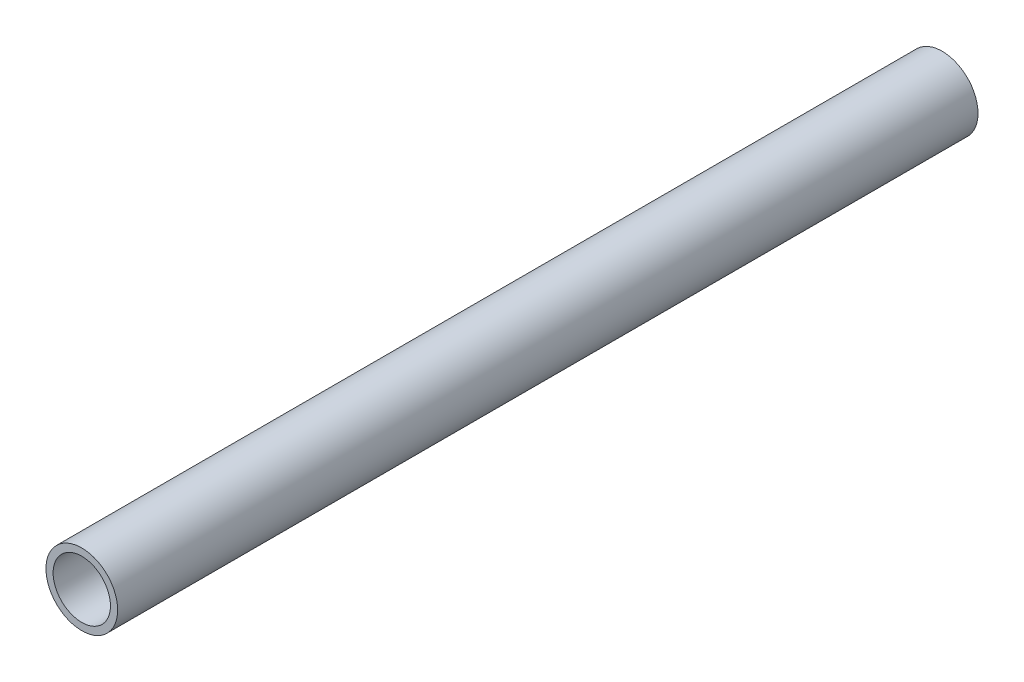
ISO-10303-21;
HEADER;
FILE_DESCRIPTION(('STEP AP214'),'2;1');
FILE_NAME('part.step','',(''),(''),'','','');
FILE_SCHEMA(('AUTOMOTIVE_DESIGN { 1 0 10303 214 1 1 1 1 }'));
ENDSEC;
DATA;
#1=APPLICATION_CONTEXT('core data for automotive mechanical design processes');
#2=APPLICATION_PROTOCOL_DEFINITION('international standard','automotive_design',2000,#1);
#3=PRODUCT_CONTEXT('',#1,'mechanical');
#4=PRODUCT('Part','Part','',(#3));
#5=PRODUCT_RELATED_PRODUCT_CATEGORY('part','',(#4));
#6=PRODUCT_DEFINITION_FORMATION('','',#4);
#7=PRODUCT_DEFINITION_CONTEXT('part definition',#1,'design');
#8=PRODUCT_DEFINITION('design','',#6,#7);
#9=PRODUCT_DEFINITION_SHAPE('','',#8);
#10=(LENGTH_UNIT() NAMED_UNIT(*) SI_UNIT(.MILLI.,.METRE.));
#11=(NAMED_UNIT(*) PLANE_ANGLE_UNIT() SI_UNIT($,.RADIAN.));
#12=(NAMED_UNIT(*) SI_UNIT($,.STERADIAN.) SOLID_ANGLE_UNIT());
#13=UNCERTAINTY_MEASURE_WITH_UNIT(LENGTH_MEASURE(1.E-05),#10,'distance_accuracy_value','');
#14=(GEOMETRIC_REPRESENTATION_CONTEXT(3) GLOBAL_UNCERTAINTY_ASSIGNED_CONTEXT((#13)) GLOBAL_UNIT_ASSIGNED_CONTEXT((#10,
#11,#12)) REPRESENTATION_CONTEXT('',''));
#15=CARTESIAN_POINT('',(0.,0.,0.));
#16=DIRECTION('',(0.,0.,1.));
#17=DIRECTION('',(1.,0.,0.));
#18=AXIS2_PLACEMENT_3D('',#15,#16,#17);
#19=CARTESIAN_POINT('',(0.,0.,190.5));
#20=DIRECTION('',(0.,0.,1.));
#21=DIRECTION('',(1.,0.,0.));
#22=AXIS2_PLACEMENT_3D('',#19,#20,#21);
#23=PLANE('',#22);
#24=CARTESIAN_POINT('',(0.,0.,190.5));
#25=DIRECTION('',(0.,0.,1.));
#26=DIRECTION('',(1.,0.,0.));
#27=AXIS2_PLACEMENT_3D('',#24,#25,#26);
#28=CIRCLE('',#27,15.875);
#29=CARTESIAN_POINT('',(15.875,0.,190.5));
#30=VERTEX_POINT('',#29);
#31=EDGE_CURVE('E10',#30,#30,#28,.T.);
#32=ORIENTED_EDGE('',*,*,#31,.T.);
#33=EDGE_LOOP('',(#32));
#34=FACE_BOUND('',#33,.T.);
#35=CARTESIAN_POINT('',(0.,0.,190.5));
#36=DIRECTION('',(0.,0.,1.));
#37=DIRECTION('',(1.,0.,0.));
#38=AXIS2_PLACEMENT_3D('',#35,#36,#37);
#39=CIRCLE('',#38,12.7);
#40=CARTESIAN_POINT('',(12.7,0.,190.5));
#41=VERTEX_POINT('',#40);
#42=EDGE_CURVE('E50',#41,#41,#39,.T.);
#43=ORIENTED_EDGE('',*,*,#42,.F.);
#44=EDGE_LOOP('',(#43));
#45=FACE_BOUND('',#44,.T.);
#46=ADVANCED_FACE('F37',(#34,#45),#23,.T.);
#47=CARTESIAN_POINT('',(0.,0.,-190.5));
#48=DIRECTION('',(0.,0.,1.));
#49=DIRECTION('',(1.,0.,0.));
#50=AXIS2_PLACEMENT_3D('',#47,#48,#49);
#51=PLANE('',#50);
#52=CARTESIAN_POINT('',(0.,0.,-190.5));
#53=DIRECTION('',(0.,0.,1.));
#54=DIRECTION('',(1.,0.,0.));
#55=AXIS2_PLACEMENT_3D('',#52,#53,#54);
#56=CIRCLE('',#55,15.875);
#57=CARTESIAN_POINT('',(15.875,0.,-190.5));
#58=VERTEX_POINT('',#57);
#59=EDGE_CURVE('E41',#58,#58,#56,.T.);
#60=ORIENTED_EDGE('',*,*,#59,.F.);
#61=EDGE_LOOP('',(#60));
#62=FACE_BOUND('',#61,.T.);
#63=CARTESIAN_POINT('',(0.,0.,-190.5));
#64=DIRECTION('',(0.,0.,1.));
#65=DIRECTION('',(1.,0.,0.));
#66=AXIS2_PLACEMENT_3D('',#63,#64,#65);
#67=CIRCLE('',#66,12.7);
#68=CARTESIAN_POINT('',(12.7,0.,-190.5));
#69=VERTEX_POINT('',#68);
#70=EDGE_CURVE('E52',#69,#69,#67,.T.);
#71=ORIENTED_EDGE('',*,*,#70,.T.);
#72=EDGE_LOOP('',(#71));
#73=FACE_BOUND('',#72,.T.);
#74=ADVANCED_FACE('F64',(#62,#73),#51,.F.);
#75=CARTESIAN_POINT('',(0.,0.,190.5));
#76=DIRECTION('',(0.,0.,-1.));
#77=DIRECTION('',(-1.,0.,0.));
#78=AXIS2_PLACEMENT_3D('',#75,#76,#77);
#79=CYLINDRICAL_SURFACE('',#78,15.875);
#80=ORIENTED_EDGE('',*,*,#31,.F.);
#81=EDGE_LOOP('',(#80));
#82=FACE_BOUND('',#81,.T.);
#83=ORIENTED_EDGE('',*,*,#59,.T.);
#84=EDGE_LOOP('',(#83));
#85=FACE_BOUND('',#84,.T.);
#86=ADVANCED_FACE('F39',(#82,#85),#79,.T.);
#87=CARTESIAN_POINT('',(0.,0.,190.5));
#88=DIRECTION('',(0.,0.,-1.));
#89=DIRECTION('',(-1.,0.,0.));
#90=AXIS2_PLACEMENT_3D('',#87,#88,#89);
#91=CYLINDRICAL_SURFACE('',#90,12.7);
#92=ORIENTED_EDGE('',*,*,#42,.T.);
#93=EDGE_LOOP('',(#92));
#94=FACE_BOUND('',#93,.T.);
#95=ORIENTED_EDGE('',*,*,#70,.F.);
#96=EDGE_LOOP('',(#95));
#97=FACE_BOUND('',#96,.T.);
#98=ADVANCED_FACE('F60',(#94,#97),#91,.F.);
#99=CLOSED_SHELL('',(#46,#74,#86,#98));
#100=MANIFOLD_SOLID_BREP('B2',#99);
#101=ADVANCED_BREP_SHAPE_REPRESENTATION('',(#18,#100),#14);
#102=SHAPE_DEFINITION_REPRESENTATION(#9,#101);
ENDSEC;
END-ISO-10303-21;
